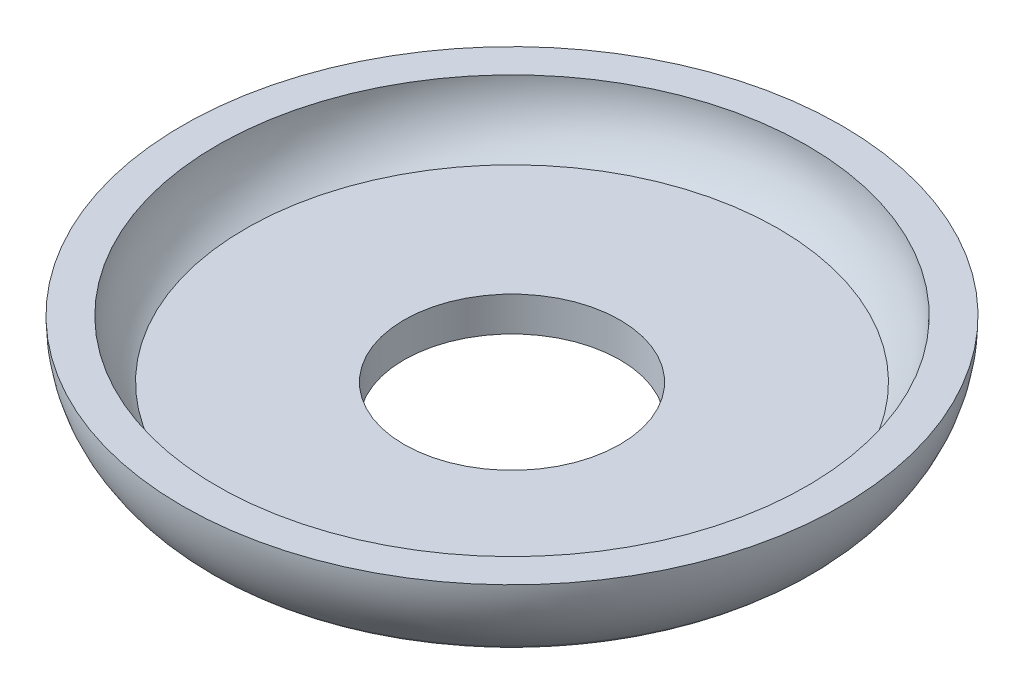
ISO-10303-21;
HEADER;
FILE_DESCRIPTION(('STEP AP214'),'2;1');
FILE_NAME('part.step','',(''),(''),'','','');
FILE_SCHEMA(('AUTOMOTIVE_DESIGN { 1 0 10303 214 1 1 1 1 }'));
ENDSEC;
DATA;
#1=APPLICATION_CONTEXT('core data for automotive mechanical design processes');
#2=APPLICATION_PROTOCOL_DEFINITION('international standard','automotive_design',2000,#1);
#3=PRODUCT_CONTEXT('',#1,'mechanical');
#4=PRODUCT('Part','Part','',(#3));
#5=PRODUCT_RELATED_PRODUCT_CATEGORY('part','',(#4));
#6=PRODUCT_DEFINITION_FORMATION('','',#4);
#7=PRODUCT_DEFINITION_CONTEXT('part definition',#1,'design');
#8=PRODUCT_DEFINITION('design','',#6,#7);
#9=PRODUCT_DEFINITION_SHAPE('','',#8);
#10=(LENGTH_UNIT() NAMED_UNIT(*) SI_UNIT(.MILLI.,.METRE.));
#11=(NAMED_UNIT(*) PLANE_ANGLE_UNIT() SI_UNIT($,.RADIAN.));
#12=(NAMED_UNIT(*) SI_UNIT($,.STERADIAN.) SOLID_ANGLE_UNIT());
#13=UNCERTAINTY_MEASURE_WITH_UNIT(LENGTH_MEASURE(1.E-05),#10,'distance_accuracy_value','');
#14=(GEOMETRIC_REPRESENTATION_CONTEXT(3) GLOBAL_UNCERTAINTY_ASSIGNED_CONTEXT((#13)) GLOBAL_UNIT_ASSIGNED_CONTEXT((#10,
#11,#12)) REPRESENTATION_CONTEXT('',''));
#15=CARTESIAN_POINT('',(0.,0.,0.));
#16=DIRECTION('',(0.,0.,1.));
#17=DIRECTION('',(1.,0.,0.));
#18=AXIS2_PLACEMENT_3D('',#15,#16,#17);
#19=CARTESIAN_POINT('',(0.,0.,0.));
#20=DIRECTION('',(0.,-1.,0.));
#21=DIRECTION('',(0.,0.,-1.));
#22=AXIS2_PLACEMENT_3D('',#19,#20,#21);
#23=CYLINDRICAL_SURFACE('',#22,4.7625);
#24=CARTESIAN_POINT('',(0.,0.,0.));
#25=DIRECTION('',(0.,-1.,0.));
#26=DIRECTION('',(0.,0.,-1.));
#27=AXIS2_PLACEMENT_3D('',#24,#25,#26);
#28=CIRCLE('',#27,4.7625);
#29=CARTESIAN_POINT('',(0.,0.,-4.7625));
#30=VERTEX_POINT('',#29);
#31=EDGE_CURVE('E10',#30,#30,#28,.T.);
#32=ORIENTED_EDGE('',*,*,#31,.T.);
#33=EDGE_LOOP('',(#32));
#34=FACE_BOUND('',#33,.T.);
#35=CARTESIAN_POINT('',(0.,1.524,0.));
#36=DIRECTION('',(0.,-1.,0.));
#37=DIRECTION('',(0.,0.,-1.));
#38=AXIS2_PLACEMENT_3D('',#35,#36,#37);
#39=CIRCLE('',#38,4.7625);
#40=CARTESIAN_POINT('',(0.,1.524,-4.7625));
#41=VERTEX_POINT('',#40);
#42=EDGE_CURVE('E55',#41,#41,#39,.T.);
#43=ORIENTED_EDGE('',*,*,#42,.F.);
#44=EDGE_LOOP('',(#43));
#45=FACE_BOUND('',#44,.T.);
#46=ADVANCED_FACE('F30',(#34,#45),#23,.F.);
#47=CARTESIAN_POINT('',(4.7625,0.,0.));
#48=DIRECTION('',(0.,-1.,0.));
#49=DIRECTION('',(0.,0.,-1.));
#50=AXIS2_PLACEMENT_3D('',#47,#48,#49);
#51=PLANE('',#50);
#52=CARTESIAN_POINT('',(0.,0.,0.));
#53=DIRECTION('',(0.,-1.,0.));
#54=DIRECTION('',(0.,0.,-1.));
#55=AXIS2_PLACEMENT_3D('',#52,#53,#54);
#56=CIRCLE('',#55,11.3717825115066);
#57=CARTESIAN_POINT('',(0.,0.,-11.3717825115066));
#58=VERTEX_POINT('',#57);
#59=EDGE_CURVE('E36',#58,#58,#56,.T.);
#60=ORIENTED_EDGE('',*,*,#59,.T.);
#61=EDGE_LOOP('',(#60));
#62=FACE_BOUND('',#61,.T.);
#63=ORIENTED_EDGE('',*,*,#31,.F.);
#64=EDGE_LOOP('',(#63));
#65=FACE_BOUND('',#64,.T.);
#66=ADVANCED_FACE('F63',(#62,#65),#51,.T.);
#67=CARTESIAN_POINT('',(0.,2.54,0.));
#68=DIRECTION('',(0.,-1.,0.));
#69=DIRECTION('',(0.,0.,-1.));
#70=AXIS2_PLACEMENT_3D('',#67,#68,#69);
#71=TOROIDAL_SURFACE('',#70,11.3717825115066,2.54);
#72=CARTESIAN_POINT('',(0.,0.747058823529414,0.));
#73=DIRECTION('',(0.,-1.,0.));
#74=DIRECTION('',(0.,0.,-1.));
#75=AXIS2_PLACEMENT_3D('',#72,#73,#74);
#76=CIRCLE('',#75,13.1709384073968);
#77=CARTESIAN_POINT('',(0.,0.747058823529414,-13.1709384073968));
#78=VERTEX_POINT('',#77);
#79=EDGE_CURVE('E40',#78,#78,#76,.T.);
#80=ORIENTED_EDGE('',*,*,#79,.T.);
#81=EDGE_LOOP('',(#80));
#82=FACE_BOUND('',#81,.T.);
#83=ORIENTED_EDGE('',*,*,#59,.F.);
#84=EDGE_LOOP('',(#83));
#85=FACE_BOUND('',#84,.T.);
#86=ADVANCED_FACE('F67',(#82,#85),#71,.T.);
#87=CARTESIAN_POINT('',(0.,4.064,0.));
#88=DIRECTION('',(0.,-1.,0.));
#89=DIRECTION('',(0.,0.,-1.));
#90=AXIS2_PLACEMENT_3D('',#87,#88,#89);
#91=TOROIDAL_SURFACE('',#90,9.8425,4.699);
#92=CARTESIAN_POINT('',(0.,4.064,0.));
#93=DIRECTION('',(0.,-1.,0.));
#94=DIRECTION('',(0.,0.,-1.));
#95=AXIS2_PLACEMENT_3D('',#92,#93,#94);
#96=CIRCLE('',#95,14.5415);
#97=CARTESIAN_POINT('',(0.,4.064,-14.5415));
#98=VERTEX_POINT('',#97);
#99=EDGE_CURVE('E44',#98,#98,#96,.T.);
#100=ORIENTED_EDGE('',*,*,#99,.T.);
#101=EDGE_LOOP('',(#100));
#102=FACE_BOUND('',#101,.T.);
#103=ORIENTED_EDGE('',*,*,#79,.F.);
#104=EDGE_LOOP('',(#103));
#105=FACE_BOUND('',#104,.T.);
#106=ADVANCED_FACE('F71',(#102,#105),#91,.T.);
#107=CARTESIAN_POINT('',(13.0175,4.064,0.));
#108=DIRECTION('',(0.,1.,0.));
#109=DIRECTION('',(0.,0.,1.));
#110=AXIS2_PLACEMENT_3D('',#107,#108,#109);
#111=PLANE('',#110);
#112=CARTESIAN_POINT('',(0.,4.064,0.));
#113=DIRECTION('',(0.,-1.,0.));
#114=DIRECTION('',(0.,0.,-1.));
#115=AXIS2_PLACEMENT_3D('',#112,#113,#114);
#116=CIRCLE('',#115,13.0175);
#117=CARTESIAN_POINT('',(0.,4.064,-13.0175));
#118=VERTEX_POINT('',#117);
#119=EDGE_CURVE('E49',#118,#118,#116,.T.);
#120=ORIENTED_EDGE('',*,*,#119,.T.);
#121=EDGE_LOOP('',(#120));
#122=FACE_BOUND('',#121,.T.);
#123=ORIENTED_EDGE('',*,*,#99,.F.);
#124=EDGE_LOOP('',(#123));
#125=FACE_BOUND('',#124,.T.);
#126=ADVANCED_FACE('F78',(#122,#125),#111,.T.);
#127=CARTESIAN_POINT('',(0.,4.064,0.));
#128=DIRECTION('',(0.,-1.,0.));
#129=DIRECTION('',(0.,0.,-1.));
#130=AXIS2_PLACEMENT_3D('',#127,#128,#129);
#131=TOROIDAL_SURFACE('',#130,9.8425,3.175);
#132=CARTESIAN_POINT('',(0.,1.524,0.));
#133=DIRECTION('',(0.,-1.,0.));
#134=DIRECTION('',(0.,0.,-1.));
#135=AXIS2_PLACEMENT_3D('',#132,#133,#134);
#136=CIRCLE('',#135,11.7475);
#137=CARTESIAN_POINT('',(0.,1.524,-11.7475));
#138=VERTEX_POINT('',#137);
#139=EDGE_CURVE('E52',#138,#138,#136,.T.);
#140=ORIENTED_EDGE('',*,*,#139,.T.);
#141=EDGE_LOOP('',(#140));
#142=FACE_BOUND('',#141,.T.);
#143=ORIENTED_EDGE('',*,*,#119,.F.);
#144=EDGE_LOOP('',(#143));
#145=FACE_BOUND('',#144,.T.);
#146=ADVANCED_FACE('F82',(#142,#145),#131,.F.);
#147=CARTESIAN_POINT('',(4.7625,1.524,0.));
#148=DIRECTION('',(0.,1.,0.));
#149=DIRECTION('',(0.,0.,1.));
#150=AXIS2_PLACEMENT_3D('',#147,#148,#149);
#151=PLANE('',#150);
#152=ORIENTED_EDGE('',*,*,#42,.T.);
#153=EDGE_LOOP('',(#152));
#154=FACE_BOUND('',#153,.T.);
#155=ORIENTED_EDGE('',*,*,#139,.F.);
#156=EDGE_LOOP('',(#155));
#157=FACE_BOUND('',#156,.T.);
#158=ADVANCED_FACE('F59',(#154,#157),#151,.T.);
#159=CLOSED_SHELL('',(#46,#66,#86,#106,#126,#146,#158));
#160=MANIFOLD_SOLID_BREP('B2',#159);
#161=ADVANCED_BREP_SHAPE_REPRESENTATION('',(#18,#160),#14);
#162=SHAPE_DEFINITION_REPRESENTATION(#9,#161);
ENDSEC;
END-ISO-10303-21;
